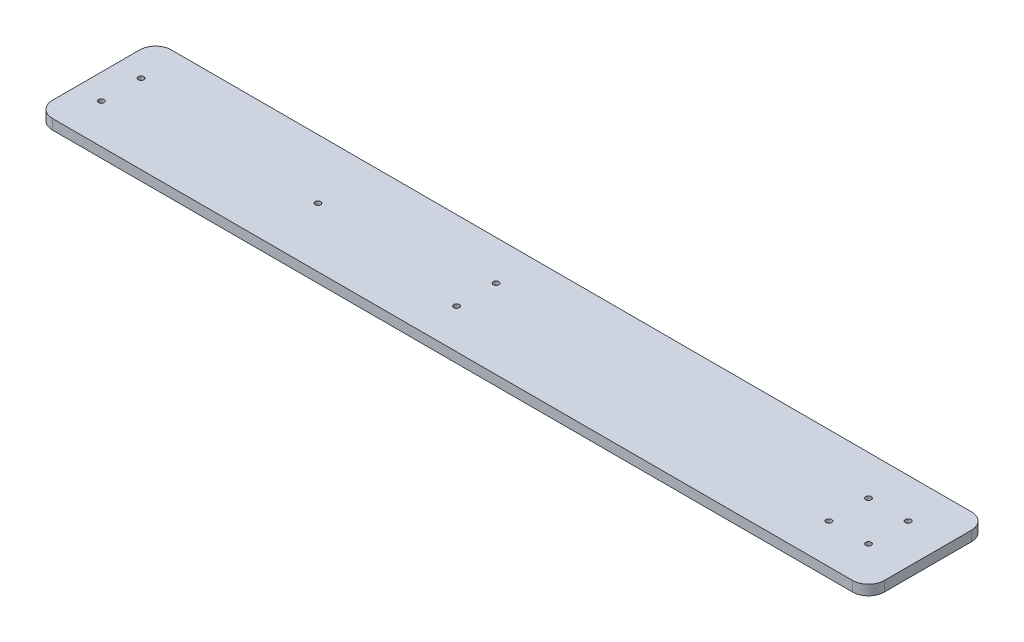
ISO-10303-21;
HEADER;
FILE_DESCRIPTION(('STEP AP214'),'2;1');
FILE_NAME('part.step','',(''),(''),'','','');
FILE_SCHEMA(('AUTOMOTIVE_DESIGN { 1 0 10303 214 1 1 1 1 }'));
ENDSEC;
DATA;
#1=APPLICATION_CONTEXT('core data for automotive mechanical design processes');
#2=APPLICATION_PROTOCOL_DEFINITION('international standard','automotive_design',2000,#1);
#3=PRODUCT_CONTEXT('',#1,'mechanical');
#4=PRODUCT('Part','Part','',(#3));
#5=PRODUCT_RELATED_PRODUCT_CATEGORY('part','',(#4));
#6=PRODUCT_DEFINITION_FORMATION('','',#4);
#7=PRODUCT_DEFINITION_CONTEXT('part definition',#1,'design');
#8=PRODUCT_DEFINITION('design','',#6,#7);
#9=PRODUCT_DEFINITION_SHAPE('','',#8);
#10=(LENGTH_UNIT() NAMED_UNIT(*) SI_UNIT(.MILLI.,.METRE.));
#11=(NAMED_UNIT(*) PLANE_ANGLE_UNIT() SI_UNIT($,.RADIAN.));
#12=(NAMED_UNIT(*) SI_UNIT($,.STERADIAN.) SOLID_ANGLE_UNIT());
#13=UNCERTAINTY_MEASURE_WITH_UNIT(LENGTH_MEASURE(1.E-05),#10,'distance_accuracy_value','');
#14=(GEOMETRIC_REPRESENTATION_CONTEXT(3) GLOBAL_UNCERTAINTY_ASSIGNED_CONTEXT((#13)) GLOBAL_UNIT_ASSIGNED_CONTEXT((#10,
#11,#12)) REPRESENTATION_CONTEXT('',''));
#15=CARTESIAN_POINT('',(0.,0.,0.));
#16=DIRECTION('',(0.,0.,1.));
#17=DIRECTION('',(1.,0.,0.));
#18=AXIS2_PLACEMENT_3D('',#15,#16,#17);
#19=CARTESIAN_POINT('',(262.5,6.35,-37.5));
#20=DIRECTION('',(-1.,0.,0.));
#21=DIRECTION('',(0.,0.,1.));
#22=AXIS2_PLACEMENT_3D('',#19,#20,#21);
#23=PLANE('',#22);
#24=DIRECTION('',(0.,0.,-1.));
#25=VECTOR('',#24,1.);
#26=CARTESIAN_POINT('',(262.5,0.,-37.5));
#27=LINE('',#26,#25);
#28=CARTESIAN_POINT('',(262.5,0.,27.5));
#29=VERTEX_POINT('',#28);
#30=CARTESIAN_POINT('',(262.5,0.,-27.5));
#31=VERTEX_POINT('',#30);
#32=EDGE_CURVE('E132',#29,#31,#27,.T.);
#33=ORIENTED_EDGE('',*,*,#32,.T.);
#34=DIRECTION('',(0.,-1.,0.));
#35=VECTOR('',#34,1.);
#36=CARTESIAN_POINT('',(262.5,6.35,-27.5));
#37=LINE('',#36,#35);
#38=CARTESIAN_POINT('',(262.5,6.35,-27.5));
#39=VERTEX_POINT('',#38);
#40=EDGE_CURVE('E110',#31,#39,#37,.F.);
#41=ORIENTED_EDGE('',*,*,#40,.T.);
#42=DIRECTION('',(0.,0.,-1.));
#43=VECTOR('',#42,1.);
#44=CARTESIAN_POINT('',(262.5,6.35,-37.5));
#45=LINE('',#44,#43);
#46=CARTESIAN_POINT('',(262.5,6.35,27.5));
#47=VERTEX_POINT('',#46);
#48=EDGE_CURVE('E142',#47,#39,#45,.T.);
#49=ORIENTED_EDGE('',*,*,#48,.F.);
#50=DIRECTION('',(0.,-1.,0.));
#51=VECTOR('',#50,1.);
#52=CARTESIAN_POINT('',(262.5,6.35,27.5));
#53=LINE('',#52,#51);
#54=EDGE_CURVE('E115',#47,#29,#53,.T.);
#55=ORIENTED_EDGE('',*,*,#54,.T.);
#56=EDGE_LOOP('',(#33,#41,#49,#55));
#57=FACE_BOUND('',#56,.T.);
#58=ADVANCED_FACE('F39',(#57),#23,.F.);
#59=CARTESIAN_POINT('',(-262.5,6.35,-37.5));
#60=DIRECTION('',(0.,0.,1.));
#61=DIRECTION('',(1.,0.,0.));
#62=AXIS2_PLACEMENT_3D('',#59,#60,#61);
#63=PLANE('',#62);
#64=DIRECTION('',(-1.,0.,0.));
#65=VECTOR('',#64,1.);
#66=CARTESIAN_POINT('',(-262.5,6.35,-37.5));
#67=LINE('',#66,#65);
#68=CARTESIAN_POINT('',(252.5,6.35,-37.5));
#69=VERTEX_POINT('',#68);
#70=CARTESIAN_POINT('',(-252.5,6.35,-37.5));
#71=VERTEX_POINT('',#70);
#72=EDGE_CURVE('E125',#69,#71,#67,.T.);
#73=ORIENTED_EDGE('',*,*,#72,.F.);
#74=DIRECTION('',(0.,-1.,0.));
#75=VECTOR('',#74,1.);
#76=CARTESIAN_POINT('',(252.5,6.35,-37.5));
#77=LINE('',#76,#75);
#78=CARTESIAN_POINT('',(252.5,0.,-37.5));
#79=VERTEX_POINT('',#78);
#80=EDGE_CURVE('E109',#69,#79,#77,.T.);
#81=ORIENTED_EDGE('',*,*,#80,.T.);
#82=DIRECTION('',(-1.,0.,0.));
#83=VECTOR('',#82,1.);
#84=CARTESIAN_POINT('',(-262.5,0.,-37.5));
#85=LINE('',#84,#83);
#86=CARTESIAN_POINT('',(-252.5,0.,-37.5));
#87=VERTEX_POINT('',#86);
#88=EDGE_CURVE('E122',#79,#87,#85,.T.);
#89=ORIENTED_EDGE('',*,*,#88,.T.);
#90=DIRECTION('',(0.,-1.,0.));
#91=VECTOR('',#90,1.);
#92=CARTESIAN_POINT('',(-252.5,6.35,-37.5));
#93=LINE('',#92,#91);
#94=EDGE_CURVE('E127',#87,#71,#93,.F.);
#95=ORIENTED_EDGE('',*,*,#94,.T.);
#96=EDGE_LOOP('',(#73,#81,#89,#95));
#97=FACE_BOUND('',#96,.T.);
#98=ADVANCED_FACE('F121',(#97),#63,.F.);
#99=CARTESIAN_POINT('',(-262.5,6.35,-37.5));
#100=DIRECTION('',(1.,0.,0.));
#101=DIRECTION('',(0.,0.,-1.));
#102=AXIS2_PLACEMENT_3D('',#99,#100,#101);
#103=PLANE('',#102);
#104=DIRECTION('',(0.,0.,1.));
#105=VECTOR('',#104,1.);
#106=CARTESIAN_POINT('',(-262.5,0.,-37.5));
#107=LINE('',#106,#105);
#108=CARTESIAN_POINT('',(-262.5,0.,-27.5));
#109=VERTEX_POINT('',#108);
#110=CARTESIAN_POINT('',(-262.5,0.,27.5));
#111=VERTEX_POINT('',#110);
#112=EDGE_CURVE('E131',#109,#111,#107,.T.);
#113=ORIENTED_EDGE('',*,*,#112,.T.);
#114=DIRECTION('',(0.,-1.,0.));
#115=VECTOR('',#114,1.);
#116=CARTESIAN_POINT('',(-262.5,6.35,27.5));
#117=LINE('',#116,#115);
#118=CARTESIAN_POINT('',(-262.5,6.35,27.5));
#119=VERTEX_POINT('',#118);
#120=EDGE_CURVE('E11',#111,#119,#117,.F.);
#121=ORIENTED_EDGE('',*,*,#120,.T.);
#122=DIRECTION('',(0.,0.,1.));
#123=VECTOR('',#122,1.);
#124=CARTESIAN_POINT('',(-262.5,6.35,-37.5));
#125=LINE('',#124,#123);
#126=CARTESIAN_POINT('',(-262.5,6.35,-27.5));
#127=VERTEX_POINT('',#126);
#128=EDGE_CURVE('E168',#127,#119,#125,.T.);
#129=ORIENTED_EDGE('',*,*,#128,.F.);
#130=DIRECTION('',(0.,-1.,0.));
#131=VECTOR('',#130,1.);
#132=CARTESIAN_POINT('',(-262.5,6.35,-27.5));
#133=LINE('',#132,#131);
#134=EDGE_CURVE('E47',#127,#109,#133,.T.);
#135=ORIENTED_EDGE('',*,*,#134,.T.);
#136=EDGE_LOOP('',(#113,#121,#129,#135));
#137=FACE_BOUND('',#136,.T.);
#138=ADVANCED_FACE('F166',(#137),#103,.F.);
#139=CARTESIAN_POINT('',(-262.5,6.35,37.5));
#140=DIRECTION('',(0.,0.,-1.));
#141=DIRECTION('',(-1.,0.,0.));
#142=AXIS2_PLACEMENT_3D('',#139,#140,#141);
#143=PLANE('',#142);
#144=DIRECTION('',(1.,0.,0.));
#145=VECTOR('',#144,1.);
#146=CARTESIAN_POINT('',(-262.5,0.,37.5));
#147=LINE('',#146,#145);
#148=CARTESIAN_POINT('',(-252.5,0.,37.5));
#149=VERTEX_POINT('',#148);
#150=CARTESIAN_POINT('',(252.5,0.,37.5));
#151=VERTEX_POINT('',#150);
#152=EDGE_CURVE('E135',#149,#151,#147,.T.);
#153=ORIENTED_EDGE('',*,*,#152,.T.);
#154=DIRECTION('',(0.,-1.,0.));
#155=VECTOR('',#154,1.);
#156=CARTESIAN_POINT('',(252.5,6.35,37.5));
#157=LINE('',#156,#155);
#158=CARTESIAN_POINT('',(252.5,6.35,37.5));
#159=VERTEX_POINT('',#158);
#160=EDGE_CURVE('E54',#151,#159,#157,.F.);
#161=ORIENTED_EDGE('',*,*,#160,.T.);
#162=DIRECTION('',(1.,0.,0.));
#163=VECTOR('',#162,1.);
#164=CARTESIAN_POINT('',(-262.5,6.35,37.5));
#165=LINE('',#164,#163);
#166=CARTESIAN_POINT('',(-252.5,6.35,37.5));
#167=VERTEX_POINT('',#166);
#168=EDGE_CURVE('E143',#167,#159,#165,.T.);
#169=ORIENTED_EDGE('',*,*,#168,.F.);
#170=DIRECTION('',(0.,-1.,0.));
#171=VECTOR('',#170,1.);
#172=CARTESIAN_POINT('',(-252.5,6.35,37.5));
#173=LINE('',#172,#171);
#174=EDGE_CURVE('E159',#167,#149,#173,.T.);
#175=ORIENTED_EDGE('',*,*,#174,.T.);
#176=EDGE_LOOP('',(#153,#161,#169,#175));
#177=FACE_BOUND('',#176,.T.);
#178=ADVANCED_FACE('F175',(#177),#143,.F.);
#179=CARTESIAN_POINT('',(0.,6.35,0.));
#180=DIRECTION('',(0.,1.,0.));
#181=DIRECTION('',(0.,0.,1.));
#182=AXIS2_PLACEMENT_3D('',#179,#180,#181);
#183=PLANE('',#182);
#184=CARTESIAN_POINT('',(-246.62,6.35,12.5));
#185=DIRECTION('',(0.,1.,0.));
#186=DIRECTION('',(0.,0.,1.));
#187=AXIS2_PLACEMENT_3D('',#184,#185,#186);
#188=CIRCLE('',#187,1.75000000000001);
#189=CARTESIAN_POINT('',(-246.62,6.35,14.25));
#190=VERTEX_POINT('',#189);
#191=EDGE_CURVE('E230',#190,#190,#188,.T.);
#192=ORIENTED_EDGE('',*,*,#191,.F.);
#193=EDGE_LOOP('',(#192));
#194=FACE_BOUND('',#193,.T.);
#195=CARTESIAN_POINT('',(-246.62,6.35,-12.5));
#196=DIRECTION('',(0.,1.,0.));
#197=DIRECTION('',(0.,0.,1.));
#198=AXIS2_PLACEMENT_3D('',#195,#196,#197);
#199=CIRCLE('',#198,1.75000000000001);
#200=CARTESIAN_POINT('',(-246.62,6.35,-10.75));
#201=VERTEX_POINT('',#200);
#202=EDGE_CURVE('E224',#201,#201,#199,.T.);
#203=ORIENTED_EDGE('',*,*,#202,.F.);
#204=EDGE_LOOP('',(#203));
#205=FACE_BOUND('',#204,.T.);
#206=CARTESIAN_POINT('',(-22.5,6.35,12.5));
#207=DIRECTION('',(0.,1.,0.));
#208=DIRECTION('',(0.,0.,1.));
#209=AXIS2_PLACEMENT_3D('',#206,#207,#208);
#210=CIRCLE('',#209,1.75);
#211=CARTESIAN_POINT('',(-22.5,6.35,14.25));
#212=VERTEX_POINT('',#211);
#213=EDGE_CURVE('E218',#212,#212,#210,.T.);
#214=ORIENTED_EDGE('',*,*,#213,.F.);
#215=EDGE_LOOP('',(#214));
#216=FACE_BOUND('',#215,.T.);
#217=CARTESIAN_POINT('',(-22.5,6.35,-12.5));
#218=DIRECTION('',(0.,1.,0.));
#219=DIRECTION('',(0.,0.,1.));
#220=AXIS2_PLACEMENT_3D('',#217,#218,#219);
#221=CIRCLE('',#220,1.75);
#222=CARTESIAN_POINT('',(-22.5,6.35,-10.75));
#223=VERTEX_POINT('',#222);
#224=EDGE_CURVE('E212',#223,#223,#221,.T.);
#225=ORIENTED_EDGE('',*,*,#224,.F.);
#226=EDGE_LOOP('',(#225));
#227=FACE_BOUND('',#226,.T.);
#228=CARTESIAN_POINT('',(-122.5,6.35,0.));
#229=DIRECTION('',(0.,-1.,0.));
#230=DIRECTION('',(0.,0.,-1.));
#231=AXIS2_PLACEMENT_3D('',#228,#229,#230);
#232=CIRCLE('',#231,1.75000000000001);
#233=CARTESIAN_POINT('',(-122.5,6.35,-1.75));
#234=VERTEX_POINT('',#233);
#235=EDGE_CURVE('E203',#234,#234,#232,.T.);
#236=ORIENTED_EDGE('',*,*,#235,.T.);
#237=EDGE_LOOP('',(#236));
#238=FACE_BOUND('',#237,.T.);
#239=CARTESIAN_POINT('',(237.5,6.35,12.5));
#240=DIRECTION('',(0.,-1.,0.));
#241=DIRECTION('',(0.,0.,-1.));
#242=AXIS2_PLACEMENT_3D('',#239,#240,#241);
#243=CIRCLE('',#242,1.75000000000001);
#244=CARTESIAN_POINT('',(237.5,6.35,10.75));
#245=VERTEX_POINT('',#244);
#246=EDGE_CURVE('E197',#245,#245,#243,.T.);
#247=ORIENTED_EDGE('',*,*,#246,.T.);
#248=EDGE_LOOP('',(#247));
#249=FACE_BOUND('',#248,.T.);
#250=CARTESIAN_POINT('',(212.5,6.35,12.5));
#251=DIRECTION('',(0.,-1.,0.));
#252=DIRECTION('',(0.,0.,-1.));
#253=AXIS2_PLACEMENT_3D('',#250,#251,#252);
#254=CIRCLE('',#253,1.75000000000001);
#255=CARTESIAN_POINT('',(212.5,6.35,10.75));
#256=VERTEX_POINT('',#255);
#257=EDGE_CURVE('E191',#256,#256,#254,.T.);
#258=ORIENTED_EDGE('',*,*,#257,.T.);
#259=EDGE_LOOP('',(#258));
#260=FACE_BOUND('',#259,.T.);
#261=CARTESIAN_POINT('',(237.5,6.35,-12.5));
#262=DIRECTION('',(0.,-1.,0.));
#263=DIRECTION('',(0.,0.,-1.));
#264=AXIS2_PLACEMENT_3D('',#261,#262,#263);
#265=CIRCLE('',#264,1.75000000000001);
#266=CARTESIAN_POINT('',(237.5,6.35,-14.25));
#267=VERTEX_POINT('',#266);
#268=EDGE_CURVE('E185',#267,#267,#265,.T.);
#269=ORIENTED_EDGE('',*,*,#268,.T.);
#270=EDGE_LOOP('',(#269));
#271=FACE_BOUND('',#270,.T.);
#272=CARTESIAN_POINT('',(212.5,6.35,-12.5));
#273=DIRECTION('',(0.,-1.,0.));
#274=DIRECTION('',(0.,0.,-1.));
#275=AXIS2_PLACEMENT_3D('',#272,#273,#274);
#276=CIRCLE('',#275,1.75000000000001);
#277=CARTESIAN_POINT('',(212.5,6.35,-14.25));
#278=VERTEX_POINT('',#277);
#279=EDGE_CURVE('E137',#278,#278,#276,.T.);
#280=ORIENTED_EDGE('',*,*,#279,.T.);
#281=EDGE_LOOP('',(#280));
#282=FACE_BOUND('',#281,.T.);
#283=ORIENTED_EDGE('',*,*,#48,.T.);
#284=CARTESIAN_POINT('',(252.5,6.35,-27.5));
#285=DIRECTION('',(0.,1.,0.));
#286=DIRECTION('',(0.,0.,1.));
#287=AXIS2_PLACEMENT_3D('',#284,#285,#286);
#288=CIRCLE('',#287,10.);
#289=EDGE_CURVE('E157',#39,#69,#288,.T.);
#290=ORIENTED_EDGE('',*,*,#289,.T.);
#291=ORIENTED_EDGE('',*,*,#72,.T.);
#292=CARTESIAN_POINT('',(-252.5,6.35,-27.5));
#293=DIRECTION('',(0.,1.,0.));
#294=DIRECTION('',(0.,0.,1.));
#295=AXIS2_PLACEMENT_3D('',#292,#293,#294);
#296=CIRCLE('',#295,10.);
#297=EDGE_CURVE('E152',#71,#127,#296,.T.);
#298=ORIENTED_EDGE('',*,*,#297,.T.);
#299=ORIENTED_EDGE('',*,*,#128,.T.);
#300=CARTESIAN_POINT('',(-252.5,6.35,27.5));
#301=DIRECTION('',(0.,1.,0.));
#302=DIRECTION('',(0.,0.,1.));
#303=AXIS2_PLACEMENT_3D('',#300,#301,#302);
#304=CIRCLE('',#303,10.);
#305=EDGE_CURVE('E61',#119,#167,#304,.T.);
#306=ORIENTED_EDGE('',*,*,#305,.T.);
#307=ORIENTED_EDGE('',*,*,#168,.T.);
#308=CARTESIAN_POINT('',(252.5,6.35,27.5));
#309=DIRECTION('',(0.,1.,0.));
#310=DIRECTION('',(0.,0.,1.));
#311=AXIS2_PLACEMENT_3D('',#308,#309,#310);
#312=CIRCLE('',#311,10.);
#313=EDGE_CURVE('E155',#159,#47,#312,.T.);
#314=ORIENTED_EDGE('',*,*,#313,.T.);
#315=EDGE_LOOP('',(#283,#290,#291,#298,#299,#306,#307,#314));
#316=FACE_BOUND('',#315,.T.);
#317=ADVANCED_FACE('F245',(#194,#205,#216,#227,#238,#249,#260,#271,#282,#316),#183,.T.);
#318=CARTESIAN_POINT('',(0.,0.,0.));
#319=DIRECTION('',(0.,1.,0.));
#320=DIRECTION('',(0.,0.,1.));
#321=AXIS2_PLACEMENT_3D('',#318,#319,#320);
#322=PLANE('',#321);
#323=CARTESIAN_POINT('',(-246.62,0.,12.5));
#324=DIRECTION('',(0.,1.,0.));
#325=DIRECTION('',(0.,0.,1.));
#326=AXIS2_PLACEMENT_3D('',#323,#324,#325);
#327=CIRCLE('',#326,1.75000000000001);
#328=CARTESIAN_POINT('',(-246.62,0.,14.25));
#329=VERTEX_POINT('',#328);
#330=EDGE_CURVE('E227',#329,#329,#327,.T.);
#331=ORIENTED_EDGE('',*,*,#330,.T.);
#332=EDGE_LOOP('',(#331));
#333=FACE_BOUND('',#332,.T.);
#334=CARTESIAN_POINT('',(-246.62,0.,-12.5));
#335=DIRECTION('',(0.,1.,0.));
#336=DIRECTION('',(0.,0.,1.));
#337=AXIS2_PLACEMENT_3D('',#334,#335,#336);
#338=CIRCLE('',#337,1.75000000000001);
#339=CARTESIAN_POINT('',(-246.62,0.,-10.75));
#340=VERTEX_POINT('',#339);
#341=EDGE_CURVE('E221',#340,#340,#338,.T.);
#342=ORIENTED_EDGE('',*,*,#341,.T.);
#343=EDGE_LOOP('',(#342));
#344=FACE_BOUND('',#343,.T.);
#345=CARTESIAN_POINT('',(-22.5,0.,12.5));
#346=DIRECTION('',(0.,1.,0.));
#347=DIRECTION('',(0.,0.,1.));
#348=AXIS2_PLACEMENT_3D('',#345,#346,#347);
#349=CIRCLE('',#348,1.75);
#350=CARTESIAN_POINT('',(-22.5,0.,14.25));
#351=VERTEX_POINT('',#350);
#352=EDGE_CURVE('E215',#351,#351,#349,.T.);
#353=ORIENTED_EDGE('',*,*,#352,.T.);
#354=EDGE_LOOP('',(#353));
#355=FACE_BOUND('',#354,.T.);
#356=CARTESIAN_POINT('',(-22.5,0.,-12.5));
#357=DIRECTION('',(0.,1.,0.));
#358=DIRECTION('',(0.,0.,1.));
#359=AXIS2_PLACEMENT_3D('',#356,#357,#358);
#360=CIRCLE('',#359,1.75);
#361=CARTESIAN_POINT('',(-22.5,0.,-10.75));
#362=VERTEX_POINT('',#361);
#363=EDGE_CURVE('E209',#362,#362,#360,.T.);
#364=ORIENTED_EDGE('',*,*,#363,.T.);
#365=EDGE_LOOP('',(#364));
#366=FACE_BOUND('',#365,.T.);
#367=CARTESIAN_POINT('',(-122.5,0.,0.));
#368=DIRECTION('',(0.,-1.,0.));
#369=DIRECTION('',(0.,0.,-1.));
#370=AXIS2_PLACEMENT_3D('',#367,#368,#369);
#371=CIRCLE('',#370,1.75000000000001);
#372=CARTESIAN_POINT('',(-122.5,0.,-1.75));
#373=VERTEX_POINT('',#372);
#374=EDGE_CURVE('E206',#373,#373,#371,.T.);
#375=ORIENTED_EDGE('',*,*,#374,.F.);
#376=EDGE_LOOP('',(#375));
#377=FACE_BOUND('',#376,.T.);
#378=CARTESIAN_POINT('',(237.5,0.,12.5));
#379=DIRECTION('',(0.,-1.,0.));
#380=DIRECTION('',(0.,0.,-1.));
#381=AXIS2_PLACEMENT_3D('',#378,#379,#380);
#382=CIRCLE('',#381,1.75000000000001);
#383=CARTESIAN_POINT('',(237.5,0.,10.75));
#384=VERTEX_POINT('',#383);
#385=EDGE_CURVE('E200',#384,#384,#382,.T.);
#386=ORIENTED_EDGE('',*,*,#385,.F.);
#387=EDGE_LOOP('',(#386));
#388=FACE_BOUND('',#387,.T.);
#389=CARTESIAN_POINT('',(212.5,0.,12.5));
#390=DIRECTION('',(0.,-1.,0.));
#391=DIRECTION('',(0.,0.,-1.));
#392=AXIS2_PLACEMENT_3D('',#389,#390,#391);
#393=CIRCLE('',#392,1.75000000000001);
#394=CARTESIAN_POINT('',(212.5,0.,10.75));
#395=VERTEX_POINT('',#394);
#396=EDGE_CURVE('E194',#395,#395,#393,.T.);
#397=ORIENTED_EDGE('',*,*,#396,.F.);
#398=EDGE_LOOP('',(#397));
#399=FACE_BOUND('',#398,.T.);
#400=CARTESIAN_POINT('',(237.5,0.,-12.5));
#401=DIRECTION('',(0.,-1.,0.));
#402=DIRECTION('',(0.,0.,-1.));
#403=AXIS2_PLACEMENT_3D('',#400,#401,#402);
#404=CIRCLE('',#403,1.75000000000001);
#405=CARTESIAN_POINT('',(237.5,0.,-14.25));
#406=VERTEX_POINT('',#405);
#407=EDGE_CURVE('E188',#406,#406,#404,.T.);
#408=ORIENTED_EDGE('',*,*,#407,.F.);
#409=EDGE_LOOP('',(#408));
#410=FACE_BOUND('',#409,.T.);
#411=CARTESIAN_POINT('',(212.5,0.,-12.5));
#412=DIRECTION('',(0.,-1.,0.));
#413=DIRECTION('',(0.,0.,-1.));
#414=AXIS2_PLACEMENT_3D('',#411,#412,#413);
#415=CIRCLE('',#414,1.75000000000001);
#416=CARTESIAN_POINT('',(212.5,0.,-14.25));
#417=VERTEX_POINT('',#416);
#418=EDGE_CURVE('E182',#417,#417,#415,.T.);
#419=ORIENTED_EDGE('',*,*,#418,.F.);
#420=EDGE_LOOP('',(#419));
#421=FACE_BOUND('',#420,.T.);
#422=ORIENTED_EDGE('',*,*,#88,.F.);
#423=CARTESIAN_POINT('',(252.5,0.,-27.5));
#424=DIRECTION('',(0.,1.,0.));
#425=DIRECTION('',(0.,0.,1.));
#426=AXIS2_PLACEMENT_3D('',#423,#424,#425);
#427=CIRCLE('',#426,10.);
#428=EDGE_CURVE('E105',#79,#31,#427,.F.);
#429=ORIENTED_EDGE('',*,*,#428,.T.);
#430=ORIENTED_EDGE('',*,*,#32,.F.);
#431=CARTESIAN_POINT('',(252.5,0.,27.5));
#432=DIRECTION('',(0.,1.,0.));
#433=DIRECTION('',(0.,0.,1.));
#434=AXIS2_PLACEMENT_3D('',#431,#432,#433);
#435=CIRCLE('',#434,10.);
#436=EDGE_CURVE('E116',#29,#151,#435,.F.);
#437=ORIENTED_EDGE('',*,*,#436,.T.);
#438=ORIENTED_EDGE('',*,*,#152,.F.);
#439=CARTESIAN_POINT('',(-252.5,0.,27.5));
#440=DIRECTION('',(0.,1.,0.));
#441=DIRECTION('',(0.,0.,1.));
#442=AXIS2_PLACEMENT_3D('',#439,#440,#441);
#443=CIRCLE('',#442,10.);
#444=EDGE_CURVE('E146',#149,#111,#443,.F.);
#445=ORIENTED_EDGE('',*,*,#444,.T.);
#446=ORIENTED_EDGE('',*,*,#112,.F.);
#447=CARTESIAN_POINT('',(-252.5,0.,-27.5));
#448=DIRECTION('',(0.,1.,0.));
#449=DIRECTION('',(0.,0.,1.));
#450=AXIS2_PLACEMENT_3D('',#447,#448,#449);
#451=CIRCLE('',#450,10.);
#452=EDGE_CURVE('E126',#109,#87,#451,.F.);
#453=ORIENTED_EDGE('',*,*,#452,.T.);
#454=EDGE_LOOP('',(#422,#429,#430,#437,#438,#445,#446,#453));
#455=FACE_BOUND('',#454,.T.);
#456=ADVANCED_FACE('F129',(#333,#344,#355,#366,#377,#388,#399,#410,#421,#455),#322,.F.);
#457=CARTESIAN_POINT('',(212.5,6.35,-12.5));
#458=DIRECTION('',(0.,-1.,0.));
#459=DIRECTION('',(0.,0.,-1.));
#460=AXIS2_PLACEMENT_3D('',#457,#458,#459);
#461=CYLINDRICAL_SURFACE('',#460,1.75000000000001);
#462=ORIENTED_EDGE('',*,*,#279,.F.);
#463=EDGE_LOOP('',(#462));
#464=FACE_BOUND('',#463,.T.);
#465=ORIENTED_EDGE('',*,*,#418,.T.);
#466=EDGE_LOOP('',(#465));
#467=FACE_BOUND('',#466,.T.);
#468=ADVANCED_FACE('F289',(#464,#467),#461,.F.);
#469=CARTESIAN_POINT('',(237.5,6.35,-12.5));
#470=DIRECTION('',(0.,-1.,0.));
#471=DIRECTION('',(0.,0.,-1.));
#472=AXIS2_PLACEMENT_3D('',#469,#470,#471);
#473=CYLINDRICAL_SURFACE('',#472,1.75000000000001);
#474=ORIENTED_EDGE('',*,*,#268,.F.);
#475=EDGE_LOOP('',(#474));
#476=FACE_BOUND('',#475,.T.);
#477=ORIENTED_EDGE('',*,*,#407,.T.);
#478=EDGE_LOOP('',(#477));
#479=FACE_BOUND('',#478,.T.);
#480=ADVANCED_FACE('F293',(#476,#479),#473,.F.);
#481=CARTESIAN_POINT('',(212.5,6.35,12.5));
#482=DIRECTION('',(0.,-1.,0.));
#483=DIRECTION('',(0.,0.,-1.));
#484=AXIS2_PLACEMENT_3D('',#481,#482,#483);
#485=CYLINDRICAL_SURFACE('',#484,1.75000000000001);
#486=ORIENTED_EDGE('',*,*,#257,.F.);
#487=EDGE_LOOP('',(#486));
#488=FACE_BOUND('',#487,.T.);
#489=ORIENTED_EDGE('',*,*,#396,.T.);
#490=EDGE_LOOP('',(#489));
#491=FACE_BOUND('',#490,.T.);
#492=ADVANCED_FACE('F297',(#488,#491),#485,.F.);
#493=CARTESIAN_POINT('',(237.5,6.35,12.5));
#494=DIRECTION('',(0.,-1.,0.));
#495=DIRECTION('',(0.,0.,-1.));
#496=AXIS2_PLACEMENT_3D('',#493,#494,#495);
#497=CYLINDRICAL_SURFACE('',#496,1.75000000000001);
#498=ORIENTED_EDGE('',*,*,#246,.F.);
#499=EDGE_LOOP('',(#498));
#500=FACE_BOUND('',#499,.T.);
#501=ORIENTED_EDGE('',*,*,#385,.T.);
#502=EDGE_LOOP('',(#501));
#503=FACE_BOUND('',#502,.T.);
#504=ADVANCED_FACE('F301',(#500,#503),#497,.F.);
#505=CARTESIAN_POINT('',(-122.5,6.35,0.));
#506=DIRECTION('',(0.,-1.,0.));
#507=DIRECTION('',(0.,0.,-1.));
#508=AXIS2_PLACEMENT_3D('',#505,#506,#507);
#509=CYLINDRICAL_SURFACE('',#508,1.75000000000001);
#510=ORIENTED_EDGE('',*,*,#235,.F.);
#511=EDGE_LOOP('',(#510));
#512=FACE_BOUND('',#511,.T.);
#513=ORIENTED_EDGE('',*,*,#374,.T.);
#514=EDGE_LOOP('',(#513));
#515=FACE_BOUND('',#514,.T.);
#516=ADVANCED_FACE('F275',(#512,#515),#509,.F.);
#517=CARTESIAN_POINT('',(252.5,6.35,-27.5));
#518=DIRECTION('',(0.,-1.,0.));
#519=DIRECTION('',(0.,0.,-1.));
#520=AXIS2_PLACEMENT_3D('',#517,#518,#519);
#521=CYLINDRICAL_SURFACE('',#520,10.);
#522=ORIENTED_EDGE('',*,*,#289,.F.);
#523=ORIENTED_EDGE('',*,*,#40,.F.);
#524=ORIENTED_EDGE('',*,*,#428,.F.);
#525=ORIENTED_EDGE('',*,*,#80,.F.);
#526=EDGE_LOOP('',(#522,#523,#524,#525));
#527=FACE_BOUND('',#526,.T.);
#528=ADVANCED_FACE('F108',(#527),#521,.T.);
#529=CARTESIAN_POINT('',(252.5,6.35,27.5));
#530=DIRECTION('',(0.,-1.,0.));
#531=DIRECTION('',(0.,0.,-1.));
#532=AXIS2_PLACEMENT_3D('',#529,#530,#531);
#533=CYLINDRICAL_SURFACE('',#532,10.);
#534=ORIENTED_EDGE('',*,*,#313,.F.);
#535=ORIENTED_EDGE('',*,*,#160,.F.);
#536=ORIENTED_EDGE('',*,*,#436,.F.);
#537=ORIENTED_EDGE('',*,*,#54,.F.);
#538=EDGE_LOOP('',(#534,#535,#536,#537));
#539=FACE_BOUND('',#538,.T.);
#540=ADVANCED_FACE('F268',(#539),#533,.T.);
#541=CARTESIAN_POINT('',(-252.5,6.35,27.5));
#542=DIRECTION('',(0.,-1.,0.));
#543=DIRECTION('',(0.,0.,-1.));
#544=AXIS2_PLACEMENT_3D('',#541,#542,#543);
#545=CYLINDRICAL_SURFACE('',#544,10.);
#546=ORIENTED_EDGE('',*,*,#305,.F.);
#547=ORIENTED_EDGE('',*,*,#120,.F.);
#548=ORIENTED_EDGE('',*,*,#444,.F.);
#549=ORIENTED_EDGE('',*,*,#174,.F.);
#550=EDGE_LOOP('',(#546,#547,#548,#549));
#551=FACE_BOUND('',#550,.T.);
#552=ADVANCED_FACE('F174',(#551),#545,.T.);
#553=CARTESIAN_POINT('',(-252.5,6.35,-27.5));
#554=DIRECTION('',(0.,-1.,0.));
#555=DIRECTION('',(0.,0.,-1.));
#556=AXIS2_PLACEMENT_3D('',#553,#554,#555);
#557=CYLINDRICAL_SURFACE('',#556,10.);
#558=ORIENTED_EDGE('',*,*,#297,.F.);
#559=ORIENTED_EDGE('',*,*,#94,.F.);
#560=ORIENTED_EDGE('',*,*,#452,.F.);
#561=ORIENTED_EDGE('',*,*,#134,.F.);
#562=EDGE_LOOP('',(#558,#559,#560,#561));
#563=FACE_BOUND('',#562,.T.);
#564=ADVANCED_FACE('F41',(#563),#557,.T.);
#565=CARTESIAN_POINT('',(-22.5,0.,-12.5));
#566=DIRECTION('',(0.,1.,0.));
#567=DIRECTION('',(0.,0.,1.));
#568=AXIS2_PLACEMENT_3D('',#565,#566,#567);
#569=CYLINDRICAL_SURFACE('',#568,1.75);
#570=ORIENTED_EDGE('',*,*,#363,.F.);
#571=EDGE_LOOP('',(#570));
#572=FACE_BOUND('',#571,.T.);
#573=ORIENTED_EDGE('',*,*,#224,.T.);
#574=EDGE_LOOP('',(#573));
#575=FACE_BOUND('',#574,.T.);
#576=ADVANCED_FACE('F309',(#572,#575),#569,.F.);
#577=CARTESIAN_POINT('',(-22.5,0.,12.5));
#578=DIRECTION('',(0.,1.,0.));
#579=DIRECTION('',(0.,0.,1.));
#580=AXIS2_PLACEMENT_3D('',#577,#578,#579);
#581=CYLINDRICAL_SURFACE('',#580,1.75);
#582=ORIENTED_EDGE('',*,*,#352,.F.);
#583=EDGE_LOOP('',(#582));
#584=FACE_BOUND('',#583,.T.);
#585=ORIENTED_EDGE('',*,*,#213,.T.);
#586=EDGE_LOOP('',(#585));
#587=FACE_BOUND('',#586,.T.);
#588=ADVANCED_FACE('F312',(#584,#587),#581,.F.);
#589=CARTESIAN_POINT('',(-246.62,0.,-12.5));
#590=DIRECTION('',(0.,1.,0.));
#591=DIRECTION('',(0.,0.,1.));
#592=AXIS2_PLACEMENT_3D('',#589,#590,#591);
#593=CYLINDRICAL_SURFACE('',#592,1.75000000000001);
#594=ORIENTED_EDGE('',*,*,#341,.F.);
#595=EDGE_LOOP('',(#594));
#596=FACE_BOUND('',#595,.T.);
#597=ORIENTED_EDGE('',*,*,#202,.T.);
#598=EDGE_LOOP('',(#597));
#599=FACE_BOUND('',#598,.T.);
#600=ADVANCED_FACE('F241',(#596,#599),#593,.F.);
#601=CARTESIAN_POINT('',(-246.62,0.,12.5));
#602=DIRECTION('',(0.,1.,0.));
#603=DIRECTION('',(0.,0.,1.));
#604=AXIS2_PLACEMENT_3D('',#601,#602,#603);
#605=CYLINDRICAL_SURFACE('',#604,1.75000000000001);
#606=ORIENTED_EDGE('',*,*,#330,.F.);
#607=EDGE_LOOP('',(#606));
#608=FACE_BOUND('',#607,.T.);
#609=ORIENTED_EDGE('',*,*,#191,.T.);
#610=EDGE_LOOP('',(#609));
#611=FACE_BOUND('',#610,.T.);
#612=ADVANCED_FACE('F238',(#608,#611),#605,.F.);
#613=CLOSED_SHELL('',(#58,#98,#138,#178,#317,#456,#468,#480,#492,#504,#516,#528,#540,#552,#564,
#576,#588,#600,#612));
#614=MANIFOLD_SOLID_BREP('B2',#613);
#615=ADVANCED_BREP_SHAPE_REPRESENTATION('',(#18,#614),#14);
#616=SHAPE_DEFINITION_REPRESENTATION(#9,#615);
ENDSEC;
END-ISO-10303-21;
